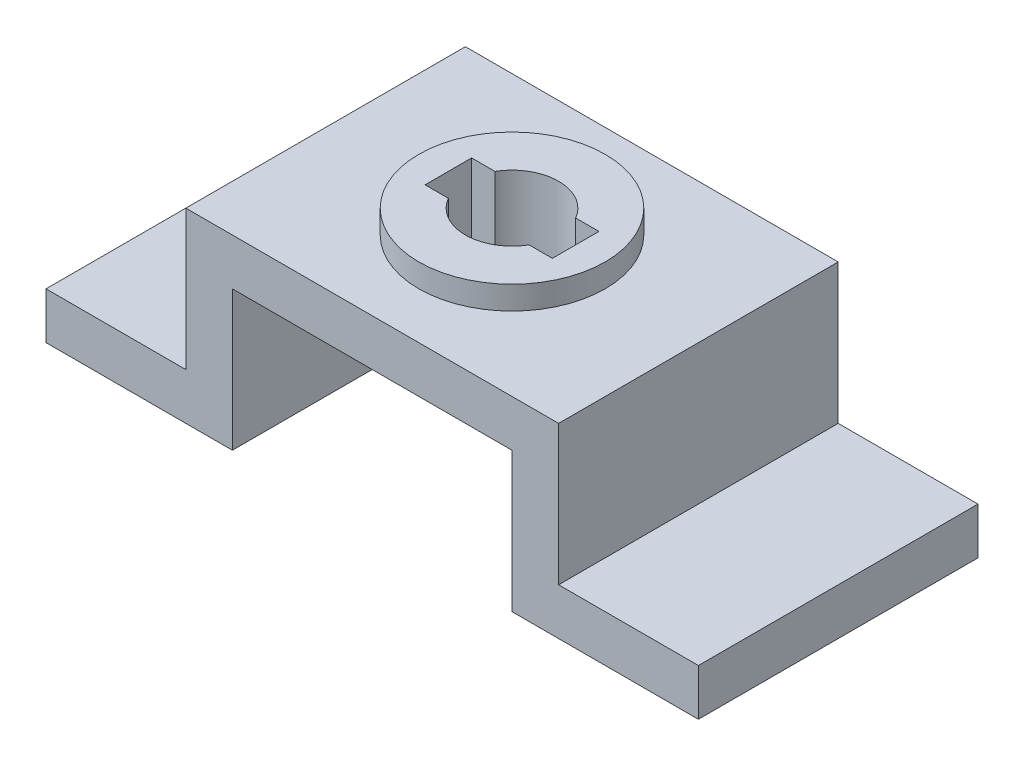
ISO-10303-21;
HEADER;
FILE_DESCRIPTION(('STEP AP214'),'2;1');
FILE_NAME('part.step','',(''),(''),'','','');
FILE_SCHEMA(('AUTOMOTIVE_DESIGN { 1 0 10303 214 1 1 1 1 }'));
ENDSEC;
DATA;
#1=APPLICATION_CONTEXT('core data for automotive mechanical design processes');
#2=APPLICATION_PROTOCOL_DEFINITION('international standard','automotive_design',2000,#1);
#3=PRODUCT_CONTEXT('',#1,'mechanical');
#4=PRODUCT('Part','Part','',(#3));
#5=PRODUCT_RELATED_PRODUCT_CATEGORY('part','',(#4));
#6=PRODUCT_DEFINITION_FORMATION('','',#4);
#7=PRODUCT_DEFINITION_CONTEXT('part definition',#1,'design');
#8=PRODUCT_DEFINITION('design','',#6,#7);
#9=PRODUCT_DEFINITION_SHAPE('','',#8);
#10=(LENGTH_UNIT() NAMED_UNIT(*) SI_UNIT(.MILLI.,.METRE.));
#11=(NAMED_UNIT(*) PLANE_ANGLE_UNIT() SI_UNIT($,.RADIAN.));
#12=(NAMED_UNIT(*) SI_UNIT($,.STERADIAN.) SOLID_ANGLE_UNIT());
#13=UNCERTAINTY_MEASURE_WITH_UNIT(LENGTH_MEASURE(1.E-05),#10,'distance_accuracy_value','');
#14=(GEOMETRIC_REPRESENTATION_CONTEXT(3) GLOBAL_UNCERTAINTY_ASSIGNED_CONTEXT((#13)) GLOBAL_UNIT_ASSIGNED_CONTEXT((#10,
#11,#12)) REPRESENTATION_CONTEXT('',''));
#15=CARTESIAN_POINT('',(0.,0.,0.));
#16=DIRECTION('',(0.,0.,1.));
#17=DIRECTION('',(1.,0.,0.));
#18=AXIS2_PLACEMENT_3D('',#15,#16,#17);
#19=CARTESIAN_POINT('',(0.,40.,60.));
#20=DIRECTION('',(0.,-1.,0.));
#21=DIRECTION('',(0.,0.,-1.));
#22=AXIS2_PLACEMENT_3D('',#19,#20,#21);
#23=PLANE('',#22);
#24=DIRECTION('',(-1.,0.,0.));
#25=VECTOR('',#24,1.);
#26=CARTESIAN_POINT('',(0.,40.,60.));
#27=LINE('',#26,#25);
#28=CARTESIAN_POINT('',(110.,40.,60.));
#29=VERTEX_POINT('',#28);
#30=CARTESIAN_POINT('',(30.,40.,60.));
#31=VERTEX_POINT('',#30);
#32=EDGE_CURVE('E322',#29,#31,#27,.T.);
#33=ORIENTED_EDGE('',*,*,#32,.F.);
#34=DIRECTION('',(0.,0.,1.));
#35=VECTOR('',#34,1.);
#36=CARTESIAN_POINT('',(110.,40.,0.));
#37=LINE('',#36,#35);
#38=CARTESIAN_POINT('',(110.,40.,0.));
#39=VERTEX_POINT('',#38);
#40=EDGE_CURVE('E270',#39,#29,#37,.T.);
#41=ORIENTED_EDGE('',*,*,#40,.F.);
#42=DIRECTION('',(-1.,0.,0.));
#43=VECTOR('',#42,1.);
#44=CARTESIAN_POINT('',(0.,40.,0.));
#45=LINE('',#44,#43);
#46=CARTESIAN_POINT('',(30.,40.,0.));
#47=VERTEX_POINT('',#46);
#48=EDGE_CURVE('E315',#39,#47,#45,.T.);
#49=ORIENTED_EDGE('',*,*,#48,.T.);
#50=DIRECTION('',(0.,0.,-1.));
#51=VECTOR('',#50,1.);
#52=CARTESIAN_POINT('',(30.,40.,0.));
#53=LINE('',#52,#51);
#54=EDGE_CURVE('E292',#31,#47,#53,.T.);
#55=ORIENTED_EDGE('',*,*,#54,.F.);
#56=EDGE_LOOP('',(#33,#41,#49,#55));
#57=FACE_BOUND('',#56,.T.);
#58=CARTESIAN_POINT('',(70.,40.,30.));
#59=DIRECTION('',(0.,-1.,0.));
#60=DIRECTION('',(0.,0.,-1.));
#61=AXIS2_PLACEMENT_3D('',#58,#59,#60);
#62=CIRCLE('',#61,20.);
#63=CARTESIAN_POINT('',(70.,40.,9.99999999999999));
#64=VERTEX_POINT('',#63);
#65=EDGE_CURVE('E12',#64,#64,#62,.F.);
#66=ORIENTED_EDGE('',*,*,#65,.F.);
#67=EDGE_LOOP('',(#66));
#68=FACE_BOUND('',#67,.T.);
#69=ADVANCED_FACE('F60',(#57,#68),#23,.F.);
#70=CARTESIAN_POINT('',(0.,0.,60.));
#71=DIRECTION('',(0.,1.,0.));
#72=DIRECTION('',(0.,0.,1.));
#73=AXIS2_PLACEMENT_3D('',#70,#71,#72);
#74=PLANE('',#73);
#75=DIRECTION('',(1.,0.,0.));
#76=VECTOR('',#75,1.);
#77=CARTESIAN_POINT('',(0.,0.,0.));
#78=LINE('',#77,#76);
#79=CARTESIAN_POINT('',(0.,0.,0.));
#80=VERTEX_POINT('',#79);
#81=CARTESIAN_POINT('',(40.,0.,0.));
#82=VERTEX_POINT('',#81);
#83=EDGE_CURVE('E327',#80,#82,#78,.T.);
#84=ORIENTED_EDGE('',*,*,#83,.T.);
#85=DIRECTION('',(0.,0.,1.));
#86=VECTOR('',#85,1.);
#87=CARTESIAN_POINT('',(40.,0.,0.));
#88=LINE('',#87,#86);
#89=CARTESIAN_POINT('',(40.,0.,60.));
#90=VERTEX_POINT('',#89);
#91=EDGE_CURVE('E261',#82,#90,#88,.T.);
#92=ORIENTED_EDGE('',*,*,#91,.T.);
#93=DIRECTION('',(1.,0.,0.));
#94=VECTOR('',#93,1.);
#95=CARTESIAN_POINT('',(0.,0.,60.));
#96=LINE('',#95,#94);
#97=CARTESIAN_POINT('',(0.,0.,60.));
#98=VERTEX_POINT('',#97);
#99=EDGE_CURVE('E316',#98,#90,#96,.T.);
#100=ORIENTED_EDGE('',*,*,#99,.F.);
#101=DIRECTION('',(0.,0.,-1.));
#102=VECTOR('',#101,1.);
#103=CARTESIAN_POINT('',(0.,0.,60.));
#104=LINE('',#103,#102);
#105=EDGE_CURVE('E336',#98,#80,#104,.T.);
#106=ORIENTED_EDGE('',*,*,#105,.T.);
#107=EDGE_LOOP('',(#84,#92,#100,#106));
#108=FACE_BOUND('',#107,.T.);
#109=ADVANCED_FACE('F388',(#108),#74,.F.);
#110=CARTESIAN_POINT('',(140.,0.,60.));
#111=DIRECTION('',(-1.,0.,0.));
#112=DIRECTION('',(0.,0.,1.));
#113=AXIS2_PLACEMENT_3D('',#110,#111,#112);
#114=PLANE('',#113);
#115=DIRECTION('',(0.,0.,-1.));
#116=VECTOR('',#115,1.);
#117=CARTESIAN_POINT('',(140.,10.,0.));
#118=LINE('',#117,#116);
#119=CARTESIAN_POINT('',(140.,10.,60.));
#120=VERTEX_POINT('',#119);
#121=CARTESIAN_POINT('',(140.,10.,0.));
#122=VERTEX_POINT('',#121);
#123=EDGE_CURVE('E285',#120,#122,#118,.T.);
#124=ORIENTED_EDGE('',*,*,#123,.F.);
#125=DIRECTION('',(0.,1.,0.));
#126=VECTOR('',#125,1.);
#127=CARTESIAN_POINT('',(140.,0.,60.));
#128=LINE('',#127,#126);
#129=CARTESIAN_POINT('',(140.,0.,60.));
#130=VERTEX_POINT('',#129);
#131=EDGE_CURVE('E319',#130,#120,#128,.T.);
#132=ORIENTED_EDGE('',*,*,#131,.F.);
#133=DIRECTION('',(0.,0.,-1.));
#134=VECTOR('',#133,1.);
#135=CARTESIAN_POINT('',(140.,0.,60.));
#136=LINE('',#135,#134);
#137=CARTESIAN_POINT('',(140.,0.,0.));
#138=VERTEX_POINT('',#137);
#139=EDGE_CURVE('E324',#130,#138,#136,.T.);
#140=ORIENTED_EDGE('',*,*,#139,.T.);
#141=DIRECTION('',(0.,1.,0.));
#142=VECTOR('',#141,1.);
#143=CARTESIAN_POINT('',(140.,0.,0.));
#144=LINE('',#143,#142);
#145=EDGE_CURVE('E330',#138,#122,#144,.T.);
#146=ORIENTED_EDGE('',*,*,#145,.T.);
#147=EDGE_LOOP('',(#124,#132,#140,#146));
#148=FACE_BOUND('',#147,.T.);
#149=ADVANCED_FACE('F394',(#148),#114,.F.);
#150=CARTESIAN_POINT('',(0.,0.,60.));
#151=DIRECTION('',(1.,0.,0.));
#152=DIRECTION('',(0.,0.,-1.));
#153=AXIS2_PLACEMENT_3D('',#150,#151,#152);
#154=PLANE('',#153);
#155=DIRECTION('',(0.,0.,1.));
#156=VECTOR('',#155,1.);
#157=CARTESIAN_POINT('',(0.,10.,0.));
#158=LINE('',#157,#156);
#159=CARTESIAN_POINT('',(0.,10.,0.));
#160=VERTEX_POINT('',#159);
#161=CARTESIAN_POINT('',(0.,10.,60.));
#162=VERTEX_POINT('',#161);
#163=EDGE_CURVE('E294',#160,#162,#158,.T.);
#164=ORIENTED_EDGE('',*,*,#163,.F.);
#165=DIRECTION('',(0.,-1.,0.));
#166=VECTOR('',#165,1.);
#167=CARTESIAN_POINT('',(0.,0.,0.));
#168=LINE('',#167,#166);
#169=EDGE_CURVE('E309',#160,#80,#168,.T.);
#170=ORIENTED_EDGE('',*,*,#169,.T.);
#171=ORIENTED_EDGE('',*,*,#105,.F.);
#172=DIRECTION('',(0.,-1.,0.));
#173=VECTOR('',#172,1.);
#174=CARTESIAN_POINT('',(0.,0.,60.));
#175=LINE('',#174,#173);
#176=EDGE_CURVE('E312',#162,#98,#175,.T.);
#177=ORIENTED_EDGE('',*,*,#176,.F.);
#178=EDGE_LOOP('',(#164,#170,#171,#177));
#179=FACE_BOUND('',#178,.T.);
#180=ADVANCED_FACE('F62',(#179),#154,.F.);
#181=CARTESIAN_POINT('',(100.,0.,60.));
#182=VERTEX_POINT('',#181);
#183=EDGE_CURVE('E314',#182,#130,#96,.T.);
#184=ORIENTED_EDGE('',*,*,#183,.F.);
#185=DIRECTION('',(0.,0.,1.));
#186=VECTOR('',#185,1.);
#187=CARTESIAN_POINT('',(100.,0.,0.));
#188=LINE('',#187,#186);
#189=CARTESIAN_POINT('',(100.,0.,0.));
#190=VERTEX_POINT('',#189);
#191=EDGE_CURVE('E273',#190,#182,#188,.T.);
#192=ORIENTED_EDGE('',*,*,#191,.F.);
#193=EDGE_CURVE('E326',#190,#138,#78,.T.);
#194=ORIENTED_EDGE('',*,*,#193,.T.);
#195=ORIENTED_EDGE('',*,*,#139,.F.);
#196=EDGE_LOOP('',(#184,#192,#194,#195));
#197=FACE_BOUND('',#196,.T.);
#198=ADVANCED_FACE('F396',(#197),#74,.F.);
#199=CARTESIAN_POINT('',(0.,0.,60.));
#200=DIRECTION('',(0.,0.,-1.));
#201=DIRECTION('',(-1.,0.,0.));
#202=AXIS2_PLACEMENT_3D('',#199,#200,#201);
#203=PLANE('',#202);
#204=ORIENTED_EDGE('',*,*,#99,.T.);
#205=DIRECTION('',(0.,-1.,0.));
#206=VECTOR('',#205,1.);
#207=CARTESIAN_POINT('',(40.,0.,60.));
#208=LINE('',#207,#206);
#209=CARTESIAN_POINT('',(40.,30.,60.));
#210=VERTEX_POINT('',#209);
#211=EDGE_CURVE('E242',#210,#90,#208,.T.);
#212=ORIENTED_EDGE('',*,*,#211,.F.);
#213=DIRECTION('',(-1.,0.,0.));
#214=VECTOR('',#213,1.);
#215=CARTESIAN_POINT('',(40.,30.,60.));
#216=LINE('',#215,#214);
#217=CARTESIAN_POINT('',(100.,30.,60.));
#218=VERTEX_POINT('',#217);
#219=EDGE_CURVE('E257',#218,#210,#216,.T.);
#220=ORIENTED_EDGE('',*,*,#219,.F.);
#221=DIRECTION('',(0.,1.,0.));
#222=VECTOR('',#221,1.);
#223=CARTESIAN_POINT('',(100.,0.,60.));
#224=LINE('',#223,#222);
#225=EDGE_CURVE('E263',#182,#218,#224,.T.);
#226=ORIENTED_EDGE('',*,*,#225,.F.);
#227=ORIENTED_EDGE('',*,*,#183,.T.);
#228=ORIENTED_EDGE('',*,*,#131,.T.);
#229=DIRECTION('',(1.,0.,0.));
#230=VECTOR('',#229,1.);
#231=CARTESIAN_POINT('',(140.,10.,60.));
#232=LINE('',#231,#230);
#233=CARTESIAN_POINT('',(110.,10.,60.));
#234=VERTEX_POINT('',#233);
#235=EDGE_CURVE('E283',#234,#120,#232,.T.);
#236=ORIENTED_EDGE('',*,*,#235,.F.);
#237=DIRECTION('',(0.,1.,0.));
#238=VECTOR('',#237,1.);
#239=CARTESIAN_POINT('',(110.,10.,60.));
#240=LINE('',#239,#238);
#241=EDGE_CURVE('E289',#234,#29,#240,.T.);
#242=ORIENTED_EDGE('',*,*,#241,.T.);
#243=ORIENTED_EDGE('',*,*,#32,.T.);
#244=DIRECTION('',(0.,1.,0.));
#245=VECTOR('',#244,1.);
#246=CARTESIAN_POINT('',(30.,10.,60.));
#247=LINE('',#246,#245);
#248=CARTESIAN_POINT('',(30.,10.,60.));
#249=VERTEX_POINT('',#248);
#250=EDGE_CURVE('E303',#249,#31,#247,.T.);
#251=ORIENTED_EDGE('',*,*,#250,.F.);
#252=DIRECTION('',(1.,0.,0.));
#253=VECTOR('',#252,1.);
#254=CARTESIAN_POINT('',(0.,10.,60.));
#255=LINE('',#254,#253);
#256=EDGE_CURVE('E296',#162,#249,#255,.T.);
#257=ORIENTED_EDGE('',*,*,#256,.F.);
#258=ORIENTED_EDGE('',*,*,#176,.T.);
#259=EDGE_LOOP('',(#204,#212,#220,#226,#227,#228,#236,#242,#243,#251,#257,#258));
#260=FACE_BOUND('',#259,.T.);
#261=ADVANCED_FACE('F406',(#260),#203,.F.);
#262=CARTESIAN_POINT('',(0.,0.,0.));
#263=DIRECTION('',(0.,0.,-1.));
#264=DIRECTION('',(-1.,0.,0.));
#265=AXIS2_PLACEMENT_3D('',#262,#263,#264);
#266=PLANE('',#265);
#267=DIRECTION('',(0.,-1.,0.));
#268=VECTOR('',#267,1.);
#269=CARTESIAN_POINT('',(40.,0.,0.));
#270=LINE('',#269,#268);
#271=CARTESIAN_POINT('',(40.,30.,0.));
#272=VERTEX_POINT('',#271);
#273=EDGE_CURVE('E253',#272,#82,#270,.T.);
#274=ORIENTED_EDGE('',*,*,#273,.T.);
#275=ORIENTED_EDGE('',*,*,#83,.F.);
#276=ORIENTED_EDGE('',*,*,#169,.F.);
#277=DIRECTION('',(-1.,0.,0.));
#278=VECTOR('',#277,1.);
#279=CARTESIAN_POINT('',(0.,10.,0.));
#280=LINE('',#279,#278);
#281=CARTESIAN_POINT('',(30.,10.,0.));
#282=VERTEX_POINT('',#281);
#283=EDGE_CURVE('E301',#282,#160,#280,.T.);
#284=ORIENTED_EDGE('',*,*,#283,.F.);
#285=DIRECTION('',(0.,1.,0.));
#286=VECTOR('',#285,1.);
#287=CARTESIAN_POINT('',(30.,10.,0.));
#288=LINE('',#287,#286);
#289=EDGE_CURVE('E306',#282,#47,#288,.T.);
#290=ORIENTED_EDGE('',*,*,#289,.T.);
#291=ORIENTED_EDGE('',*,*,#48,.F.);
#292=DIRECTION('',(0.,1.,0.));
#293=VECTOR('',#292,1.);
#294=CARTESIAN_POINT('',(110.,10.,0.));
#295=LINE('',#294,#293);
#296=CARTESIAN_POINT('',(110.,10.,0.));
#297=VERTEX_POINT('',#296);
#298=EDGE_CURVE('E287',#297,#39,#295,.T.);
#299=ORIENTED_EDGE('',*,*,#298,.F.);
#300=DIRECTION('',(-1.,0.,0.));
#301=VECTOR('',#300,1.);
#302=CARTESIAN_POINT('',(140.,10.,0.));
#303=LINE('',#302,#301);
#304=EDGE_CURVE('E277',#122,#297,#303,.T.);
#305=ORIENTED_EDGE('',*,*,#304,.F.);
#306=ORIENTED_EDGE('',*,*,#145,.F.);
#307=ORIENTED_EDGE('',*,*,#193,.F.);
#308=DIRECTION('',(0.,1.,0.));
#309=VECTOR('',#308,1.);
#310=CARTESIAN_POINT('',(100.,0.,0.));
#311=LINE('',#310,#309);
#312=CARTESIAN_POINT('',(100.,30.,0.));
#313=VERTEX_POINT('',#312);
#314=EDGE_CURVE('E256',#190,#313,#311,.T.);
#315=ORIENTED_EDGE('',*,*,#314,.T.);
#316=DIRECTION('',(-1.,0.,0.));
#317=VECTOR('',#316,1.);
#318=CARTESIAN_POINT('',(40.,30.,0.));
#319=LINE('',#318,#317);
#320=EDGE_CURVE('E83',#313,#272,#319,.T.);
#321=ORIENTED_EDGE('',*,*,#320,.T.);
#322=EDGE_LOOP('',(#274,#275,#276,#284,#290,#291,#299,#305,#306,#307,#315,#321));
#323=FACE_BOUND('',#322,.T.);
#324=ADVANCED_FACE('F401',(#323),#266,.T.);
#325=CARTESIAN_POINT('',(30.,10.,0.));
#326=DIRECTION('',(1.,0.,0.));
#327=DIRECTION('',(0.,0.,-1.));
#328=AXIS2_PLACEMENT_3D('',#325,#326,#327);
#329=PLANE('',#328);
#330=ORIENTED_EDGE('',*,*,#54,.T.);
#331=ORIENTED_EDGE('',*,*,#289,.F.);
#332=DIRECTION('',(0.,0.,-1.));
#333=VECTOR('',#332,1.);
#334=CARTESIAN_POINT('',(30.,10.,0.));
#335=LINE('',#334,#333);
#336=EDGE_CURVE('E299',#249,#282,#335,.T.);
#337=ORIENTED_EDGE('',*,*,#336,.F.);
#338=ORIENTED_EDGE('',*,*,#250,.T.);
#339=EDGE_LOOP('',(#330,#331,#337,#338));
#340=FACE_BOUND('',#339,.T.);
#341=ADVANCED_FACE('F440',(#340),#329,.F.);
#342=CARTESIAN_POINT('',(0.,10.,0.));
#343=DIRECTION('',(0.,1.,0.));
#344=DIRECTION('',(0.,0.,1.));
#345=AXIS2_PLACEMENT_3D('',#342,#343,#344);
#346=PLANE('',#345);
#347=ORIENTED_EDGE('',*,*,#163,.T.);
#348=ORIENTED_EDGE('',*,*,#256,.T.);
#349=ORIENTED_EDGE('',*,*,#336,.T.);
#350=ORIENTED_EDGE('',*,*,#283,.T.);
#351=EDGE_LOOP('',(#347,#348,#349,#350));
#352=FACE_BOUND('',#351,.T.);
#353=ADVANCED_FACE('F444',(#352),#346,.T.);
#354=CARTESIAN_POINT('',(110.,10.,0.));
#355=DIRECTION('',(-1.,0.,0.));
#356=DIRECTION('',(0.,0.,1.));
#357=AXIS2_PLACEMENT_3D('',#354,#355,#356);
#358=PLANE('',#357);
#359=ORIENTED_EDGE('',*,*,#40,.T.);
#360=ORIENTED_EDGE('',*,*,#241,.F.);
#361=DIRECTION('',(0.,0.,1.));
#362=VECTOR('',#361,1.);
#363=CARTESIAN_POINT('',(110.,10.,0.));
#364=LINE('',#363,#362);
#365=EDGE_CURVE('E280',#297,#234,#364,.T.);
#366=ORIENTED_EDGE('',*,*,#365,.F.);
#367=ORIENTED_EDGE('',*,*,#298,.T.);
#368=EDGE_LOOP('',(#359,#360,#366,#367));
#369=FACE_BOUND('',#368,.T.);
#370=ADVANCED_FACE('F435',(#369),#358,.F.);
#371=CARTESIAN_POINT('',(0.,10.,0.));
#372=DIRECTION('',(0.,1.,0.));
#373=DIRECTION('',(0.,0.,1.));
#374=AXIS2_PLACEMENT_3D('',#371,#372,#373);
#375=PLANE('',#374);
#376=ORIENTED_EDGE('',*,*,#304,.T.);
#377=ORIENTED_EDGE('',*,*,#365,.T.);
#378=ORIENTED_EDGE('',*,*,#235,.T.);
#379=ORIENTED_EDGE('',*,*,#123,.T.);
#380=EDGE_LOOP('',(#376,#377,#378,#379));
#381=FACE_BOUND('',#380,.T.);
#382=ADVANCED_FACE('F430',(#381),#375,.T.);
#383=CARTESIAN_POINT('',(40.,0.,0.));
#384=DIRECTION('',(-1.,0.,0.));
#385=DIRECTION('',(0.,0.,1.));
#386=AXIS2_PLACEMENT_3D('',#383,#384,#385);
#387=PLANE('',#386);
#388=ORIENTED_EDGE('',*,*,#211,.T.);
#389=ORIENTED_EDGE('',*,*,#91,.F.);
#390=ORIENTED_EDGE('',*,*,#273,.F.);
#391=DIRECTION('',(0.,0.,1.));
#392=VECTOR('',#391,1.);
#393=CARTESIAN_POINT('',(40.,30.,0.));
#394=LINE('',#393,#392);
#395=EDGE_CURVE('E268',#272,#210,#394,.T.);
#396=ORIENTED_EDGE('',*,*,#395,.T.);
#397=EDGE_LOOP('',(#388,#389,#390,#396));
#398=FACE_BOUND('',#397,.T.);
#399=ADVANCED_FACE('F452',(#398),#387,.F.);
#400=CARTESIAN_POINT('',(40.,30.,0.));
#401=DIRECTION('',(0.,1.,0.));
#402=DIRECTION('',(0.,0.,1.));
#403=AXIS2_PLACEMENT_3D('',#400,#401,#402);
#404=PLANE('',#403);
#405=DIRECTION('',(0.,0.,1.));
#406=VECTOR('',#405,1.);
#407=CARTESIAN_POINT('',(83.6602540378444,30.,0.));
#408=LINE('',#407,#406);
#409=CARTESIAN_POINT('',(83.6602540378444,30.,25.));
#410=VERTEX_POINT('',#409);
#411=CARTESIAN_POINT('',(83.6602540378444,30.,35.));
#412=VERTEX_POINT('',#411);
#413=EDGE_CURVE('E353',#410,#412,#408,.T.);
#414=ORIENTED_EDGE('',*,*,#413,.F.);
#415=DIRECTION('',(-1.,0.,0.));
#416=VECTOR('',#415,1.);
#417=CARTESIAN_POINT('',(40.,30.,25.));
#418=LINE('',#417,#416);
#419=CARTESIAN_POINT('',(78.6602540378444,30.,25.));
#420=VERTEX_POINT('',#419);
#421=EDGE_CURVE('E68',#410,#420,#418,.T.);
#422=ORIENTED_EDGE('',*,*,#421,.T.);
#423=CARTESIAN_POINT('',(70.,30.,30.));
#424=DIRECTION('',(0.,1.,0.));
#425=DIRECTION('',(0.,0.,1.));
#426=AXIS2_PLACEMENT_3D('',#423,#424,#425);
#427=CIRCLE('',#426,10.);
#428=CARTESIAN_POINT('',(61.3397459621556,30.,25.));
#429=VERTEX_POINT('',#428);
#430=EDGE_CURVE('E339',#420,#429,#427,.T.);
#431=ORIENTED_EDGE('',*,*,#430,.T.);
#432=DIRECTION('',(1.,0.,0.));
#433=VECTOR('',#432,1.);
#434=CARTESIAN_POINT('',(40.,30.,25.));
#435=LINE('',#434,#433);
#436=CARTESIAN_POINT('',(56.3397459621556,30.,25.));
#437=VERTEX_POINT('',#436);
#438=EDGE_CURVE('E202',#437,#429,#435,.T.);
#439=ORIENTED_EDGE('',*,*,#438,.F.);
#440=DIRECTION('',(0.,0.,1.));
#441=VECTOR('',#440,1.);
#442=CARTESIAN_POINT('',(56.3397459621556,30.,0.));
#443=LINE('',#442,#441);
#444=CARTESIAN_POINT('',(56.3397459621556,30.,35.));
#445=VERTEX_POINT('',#444);
#446=EDGE_CURVE('E342',#437,#445,#443,.T.);
#447=ORIENTED_EDGE('',*,*,#446,.T.);
#448=DIRECTION('',(1.,0.,0.));
#449=VECTOR('',#448,1.);
#450=CARTESIAN_POINT('',(40.,30.,35.));
#451=LINE('',#450,#449);
#452=CARTESIAN_POINT('',(61.3397459621556,30.,35.));
#453=VERTEX_POINT('',#452);
#454=EDGE_CURVE('E345',#445,#453,#451,.T.);
#455=ORIENTED_EDGE('',*,*,#454,.T.);
#456=CARTESIAN_POINT('',(70.,30.,30.));
#457=DIRECTION('',(0.,1.,0.));
#458=DIRECTION('',(0.,0.,1.));
#459=AXIS2_PLACEMENT_3D('',#456,#457,#458);
#460=CIRCLE('',#459,10.);
#461=CARTESIAN_POINT('',(78.6602540378444,30.,35.));
#462=VERTEX_POINT('',#461);
#463=EDGE_CURVE('E348',#453,#462,#460,.T.);
#464=ORIENTED_EDGE('',*,*,#463,.T.);
#465=DIRECTION('',(-1.,0.,0.));
#466=VECTOR('',#465,1.);
#467=CARTESIAN_POINT('',(40.,30.,35.));
#468=LINE('',#467,#466);
#469=EDGE_CURVE('E351',#412,#462,#468,.T.);
#470=ORIENTED_EDGE('',*,*,#469,.F.);
#471=EDGE_LOOP('',(#414,#422,#431,#439,#447,#455,#464,#470));
#472=FACE_BOUND('',#471,.T.);
#473=ORIENTED_EDGE('',*,*,#219,.T.);
#474=ORIENTED_EDGE('',*,*,#395,.F.);
#475=ORIENTED_EDGE('',*,*,#320,.F.);
#476=DIRECTION('',(0.,0.,1.));
#477=VECTOR('',#476,1.);
#478=CARTESIAN_POINT('',(100.,30.,0.));
#479=LINE('',#478,#477);
#480=EDGE_CURVE('E271',#313,#218,#479,.T.);
#481=ORIENTED_EDGE('',*,*,#480,.T.);
#482=EDGE_LOOP('',(#473,#474,#475,#481));
#483=FACE_BOUND('',#482,.T.);
#484=ADVANCED_FACE('F357',(#472,#483),#404,.F.);
#485=CARTESIAN_POINT('',(100.,0.,0.));
#486=DIRECTION('',(1.,0.,0.));
#487=DIRECTION('',(0.,0.,-1.));
#488=AXIS2_PLACEMENT_3D('',#485,#486,#487);
#489=PLANE('',#488);
#490=ORIENTED_EDGE('',*,*,#225,.T.);
#491=ORIENTED_EDGE('',*,*,#480,.F.);
#492=ORIENTED_EDGE('',*,*,#314,.F.);
#493=ORIENTED_EDGE('',*,*,#191,.T.);
#494=EDGE_LOOP('',(#490,#491,#492,#493));
#495=FACE_BOUND('',#494,.T.);
#496=ADVANCED_FACE('F424',(#495),#489,.F.);
#497=CARTESIAN_POINT('',(83.6602540378444,0.,25.));
#498=DIRECTION('',(0.,0.,-1.));
#499=DIRECTION('',(-1.,0.,0.));
#500=AXIS2_PLACEMENT_3D('',#497,#498,#499);
#501=PLANE('',#500);
#502=DIRECTION('',(0.,1.,0.));
#503=VECTOR('',#502,1.);
#504=CARTESIAN_POINT('',(83.6602540378444,0.,25.));
#505=LINE('',#504,#503);
#506=CARTESIAN_POINT('',(83.6602540378444,45.,25.));
#507=VERTEX_POINT('',#506);
#508=EDGE_CURVE('E240',#410,#507,#505,.T.);
#509=ORIENTED_EDGE('',*,*,#508,.T.);
#510=DIRECTION('',(-1.,0.,0.));
#511=VECTOR('',#510,1.);
#512=CARTESIAN_POINT('',(83.6602540378444,45.,25.));
#513=LINE('',#512,#511);
#514=CARTESIAN_POINT('',(78.6602540378444,45.,25.));
#515=VERTEX_POINT('',#514);
#516=EDGE_CURVE('E214',#507,#515,#513,.T.);
#517=ORIENTED_EDGE('',*,*,#516,.T.);
#518=DIRECTION('',(0.,1.,0.));
#519=VECTOR('',#518,1.);
#520=CARTESIAN_POINT('',(78.6602540378444,0.,25.));
#521=LINE('',#520,#519);
#522=EDGE_CURVE('E205',#420,#515,#521,.T.);
#523=ORIENTED_EDGE('',*,*,#522,.F.);
#524=ORIENTED_EDGE('',*,*,#421,.F.);
#525=EDGE_LOOP('',(#509,#517,#523,#524));
#526=FACE_BOUND('',#525,.T.);
#527=ADVANCED_FACE('F361',(#526),#501,.F.);
#528=CARTESIAN_POINT('',(83.6602540378444,0.,25.));
#529=DIRECTION('',(-1.,0.,0.));
#530=DIRECTION('',(0.,0.,1.));
#531=AXIS2_PLACEMENT_3D('',#528,#529,#530);
#532=PLANE('',#531);
#533=ORIENTED_EDGE('',*,*,#413,.T.);
#534=DIRECTION('',(0.,1.,0.));
#535=VECTOR('',#534,1.);
#536=CARTESIAN_POINT('',(83.6602540378444,0.,35.));
#537=LINE('',#536,#535);
#538=CARTESIAN_POINT('',(83.6602540378444,45.,35.));
#539=VERTEX_POINT('',#538);
#540=EDGE_CURVE('E243',#412,#539,#537,.T.);
#541=ORIENTED_EDGE('',*,*,#540,.T.);
#542=DIRECTION('',(0.,0.,1.));
#543=VECTOR('',#542,1.);
#544=CARTESIAN_POINT('',(83.6602540378444,45.,25.));
#545=LINE('',#544,#543);
#546=EDGE_CURVE('E224',#507,#539,#545,.T.);
#547=ORIENTED_EDGE('',*,*,#546,.F.);
#548=ORIENTED_EDGE('',*,*,#508,.F.);
#549=EDGE_LOOP('',(#533,#541,#547,#548));
#550=FACE_BOUND('',#549,.T.);
#551=ADVANCED_FACE('F364',(#550),#532,.T.);
#552=CARTESIAN_POINT('',(83.6602540378444,0.,35.));
#553=DIRECTION('',(0.,0.,-1.));
#554=DIRECTION('',(-1.,0.,0.));
#555=AXIS2_PLACEMENT_3D('',#552,#553,#554);
#556=PLANE('',#555);
#557=ORIENTED_EDGE('',*,*,#469,.T.);
#558=DIRECTION('',(0.,1.,0.));
#559=VECTOR('',#558,1.);
#560=CARTESIAN_POINT('',(78.6602540378444,0.,35.));
#561=LINE('',#560,#559);
#562=CARTESIAN_POINT('',(78.6602540378444,45.,35.));
#563=VERTEX_POINT('',#562);
#564=EDGE_CURVE('E245',#462,#563,#561,.T.);
#565=ORIENTED_EDGE('',*,*,#564,.T.);
#566=DIRECTION('',(-1.,0.,0.));
#567=VECTOR('',#566,1.);
#568=CARTESIAN_POINT('',(83.6602540378444,45.,35.));
#569=LINE('',#568,#567);
#570=EDGE_CURVE('E227',#539,#563,#569,.T.);
#571=ORIENTED_EDGE('',*,*,#570,.F.);
#572=ORIENTED_EDGE('',*,*,#540,.F.);
#573=EDGE_LOOP('',(#557,#565,#571,#572));
#574=FACE_BOUND('',#573,.T.);
#575=ADVANCED_FACE('F369',(#574),#556,.T.);
#576=CARTESIAN_POINT('',(70.,0.,30.));
#577=DIRECTION('',(0.,1.,0.));
#578=DIRECTION('',(0.,0.,1.));
#579=AXIS2_PLACEMENT_3D('',#576,#577,#578);
#580=CYLINDRICAL_SURFACE('',#579,10.);
#581=DIRECTION('',(0.,1.,0.));
#582=VECTOR('',#581,1.);
#583=CARTESIAN_POINT('',(61.3397459621556,0.,35.));
#584=LINE('',#583,#582);
#585=CARTESIAN_POINT('',(61.3397459621556,45.,35.));
#586=VERTEX_POINT('',#585);
#587=EDGE_CURVE('E247',#453,#586,#584,.T.);
#588=ORIENTED_EDGE('',*,*,#587,.T.);
#589=CARTESIAN_POINT('',(70.,45.,30.));
#590=DIRECTION('',(0.,1.,0.));
#591=DIRECTION('',(0.,0.,1.));
#592=AXIS2_PLACEMENT_3D('',#589,#590,#591);
#593=CIRCLE('',#592,10.);
#594=EDGE_CURVE('E230',#586,#563,#593,.T.);
#595=ORIENTED_EDGE('',*,*,#594,.T.);
#596=ORIENTED_EDGE('',*,*,#564,.F.);
#597=ORIENTED_EDGE('',*,*,#463,.F.);
#598=EDGE_LOOP('',(#588,#595,#596,#597));
#599=FACE_BOUND('',#598,.T.);
#600=ADVANCED_FACE('F372',(#599),#580,.F.);
#601=CARTESIAN_POINT('',(56.3397459621556,0.,35.));
#602=DIRECTION('',(0.,0.,1.));
#603=DIRECTION('',(1.,0.,0.));
#604=AXIS2_PLACEMENT_3D('',#601,#602,#603);
#605=PLANE('',#604);
#606=DIRECTION('',(0.,1.,0.));
#607=VECTOR('',#606,1.);
#608=CARTESIAN_POINT('',(56.3397459621556,0.,35.));
#609=LINE('',#608,#607);
#610=CARTESIAN_POINT('',(56.3397459621556,45.,35.));
#611=VERTEX_POINT('',#610);
#612=EDGE_CURVE('E249',#445,#611,#609,.T.);
#613=ORIENTED_EDGE('',*,*,#612,.T.);
#614=DIRECTION('',(1.,0.,0.));
#615=VECTOR('',#614,1.);
#616=CARTESIAN_POINT('',(56.3397459621556,45.,35.));
#617=LINE('',#616,#615);
#618=EDGE_CURVE('E233',#611,#586,#617,.T.);
#619=ORIENTED_EDGE('',*,*,#618,.T.);
#620=ORIENTED_EDGE('',*,*,#587,.F.);
#621=ORIENTED_EDGE('',*,*,#454,.F.);
#622=EDGE_LOOP('',(#613,#619,#620,#621));
#623=FACE_BOUND('',#622,.T.);
#624=ADVANCED_FACE('F375',(#623),#605,.F.);
#625=CARTESIAN_POINT('',(56.3397459621556,0.,25.));
#626=DIRECTION('',(-1.,0.,0.));
#627=DIRECTION('',(0.,0.,1.));
#628=AXIS2_PLACEMENT_3D('',#625,#626,#627);
#629=PLANE('',#628);
#630=DIRECTION('',(0.,1.,0.));
#631=VECTOR('',#630,1.);
#632=CARTESIAN_POINT('',(56.3397459621556,0.,25.));
#633=LINE('',#632,#631);
#634=CARTESIAN_POINT('',(56.3397459621556,45.,25.));
#635=VERTEX_POINT('',#634);
#636=EDGE_CURVE('E204',#437,#635,#633,.T.);
#637=ORIENTED_EDGE('',*,*,#636,.T.);
#638=DIRECTION('',(0.,0.,1.));
#639=VECTOR('',#638,1.);
#640=CARTESIAN_POINT('',(56.3397459621556,45.,25.));
#641=LINE('',#640,#639);
#642=EDGE_CURVE('E220',#635,#611,#641,.T.);
#643=ORIENTED_EDGE('',*,*,#642,.T.);
#644=ORIENTED_EDGE('',*,*,#612,.F.);
#645=ORIENTED_EDGE('',*,*,#446,.F.);
#646=EDGE_LOOP('',(#637,#643,#644,#645));
#647=FACE_BOUND('',#646,.T.);
#648=ADVANCED_FACE('F378',(#647),#629,.F.);
#649=CARTESIAN_POINT('',(56.3397459621556,0.,25.));
#650=DIRECTION('',(0.,0.,1.));
#651=DIRECTION('',(1.,0.,0.));
#652=AXIS2_PLACEMENT_3D('',#649,#650,#651);
#653=PLANE('',#652);
#654=ORIENTED_EDGE('',*,*,#438,.T.);
#655=DIRECTION('',(0.,1.,0.));
#656=VECTOR('',#655,1.);
#657=CARTESIAN_POINT('',(61.3397459621556,0.,25.));
#658=LINE('',#657,#656);
#659=CARTESIAN_POINT('',(61.3397459621556,45.,25.));
#660=VERTEX_POINT('',#659);
#661=EDGE_CURVE('E75',#429,#660,#658,.T.);
#662=ORIENTED_EDGE('',*,*,#661,.T.);
#663=DIRECTION('',(1.,0.,0.));
#664=VECTOR('',#663,1.);
#665=CARTESIAN_POINT('',(56.3397459621556,45.,25.));
#666=LINE('',#665,#664);
#667=EDGE_CURVE('E199',#635,#660,#666,.T.);
#668=ORIENTED_EDGE('',*,*,#667,.F.);
#669=ORIENTED_EDGE('',*,*,#636,.F.);
#670=EDGE_LOOP('',(#654,#662,#668,#669));
#671=FACE_BOUND('',#670,.T.);
#672=ADVANCED_FACE('F196',(#671),#653,.T.);
#673=CARTESIAN_POINT('',(70.,0.,30.));
#674=DIRECTION('',(0.,1.,0.));
#675=DIRECTION('',(0.,0.,1.));
#676=AXIS2_PLACEMENT_3D('',#673,#674,#675);
#677=CYLINDRICAL_SURFACE('',#676,10.);
#678=ORIENTED_EDGE('',*,*,#522,.T.);
#679=CARTESIAN_POINT('',(70.,45.,30.));
#680=DIRECTION('',(0.,1.,0.));
#681=DIRECTION('',(0.,0.,1.));
#682=AXIS2_PLACEMENT_3D('',#679,#680,#681);
#683=CIRCLE('',#682,10.);
#684=EDGE_CURVE('E208',#515,#660,#683,.T.);
#685=ORIENTED_EDGE('',*,*,#684,.T.);
#686=ORIENTED_EDGE('',*,*,#661,.F.);
#687=ORIENTED_EDGE('',*,*,#430,.F.);
#688=EDGE_LOOP('',(#678,#685,#686,#687));
#689=FACE_BOUND('',#688,.T.);
#690=ADVANCED_FACE('F209',(#689),#677,.F.);
#691=CARTESIAN_POINT('',(70.,45.,30.));
#692=DIRECTION('',(0.,-1.,0.));
#693=DIRECTION('',(0.,0.,-1.));
#694=AXIS2_PLACEMENT_3D('',#691,#692,#693);
#695=CYLINDRICAL_SURFACE('',#694,20.);
#696=CARTESIAN_POINT('',(70.,45.,30.));
#697=DIRECTION('',(0.,1.,0.));
#698=DIRECTION('',(0.,0.,1.));
#699=AXIS2_PLACEMENT_3D('',#696,#697,#698);
#700=CIRCLE('',#699,20.);
#701=CARTESIAN_POINT('',(70.,45.,50.));
#702=VERTEX_POINT('',#701);
#703=EDGE_CURVE('E237',#702,#702,#700,.T.);
#704=ORIENTED_EDGE('',*,*,#703,.F.);
#705=EDGE_LOOP('',(#704));
#706=FACE_BOUND('',#705,.T.);
#707=ORIENTED_EDGE('',*,*,#65,.T.);
#708=EDGE_LOOP('',(#707));
#709=FACE_BOUND('',#708,.T.);
#710=ADVANCED_FACE('F611',(#706,#709),#695,.T.);
#711=CARTESIAN_POINT('',(70.,45.,30.));
#712=DIRECTION('',(0.,1.,0.));
#713=DIRECTION('',(0.,0.,1.));
#714=AXIS2_PLACEMENT_3D('',#711,#712,#713);
#715=PLANE('',#714);
#716=ORIENTED_EDGE('',*,*,#667,.T.);
#717=ORIENTED_EDGE('',*,*,#684,.F.);
#718=ORIENTED_EDGE('',*,*,#516,.F.);
#719=ORIENTED_EDGE('',*,*,#546,.T.);
#720=ORIENTED_EDGE('',*,*,#570,.T.);
#721=ORIENTED_EDGE('',*,*,#594,.F.);
#722=ORIENTED_EDGE('',*,*,#618,.F.);
#723=ORIENTED_EDGE('',*,*,#642,.F.);
#724=EDGE_LOOP('',(#716,#717,#718,#719,#720,#721,#722,#723));
#725=FACE_BOUND('',#724,.T.);
#726=ORIENTED_EDGE('',*,*,#703,.T.);
#727=EDGE_LOOP('',(#726));
#728=FACE_BOUND('',#727,.T.);
#729=ADVANCED_FACE('F216',(#725,#728),#715,.T.);
#730=CLOSED_SHELL('',(#69,#109,#149,#180,#198,#261,#324,#341,#353,#370,#382,#399,#484,#496,#527,
#551,#575,#600,#624,#648,#672,#690,#710,#729));
#731=MANIFOLD_SOLID_BREP('B2',#730);
#732=ADVANCED_BREP_SHAPE_REPRESENTATION('',(#18,#731),#14);
#733=SHAPE_DEFINITION_REPRESENTATION(#9,#732);
ENDSEC;
END-ISO-10303-21;
